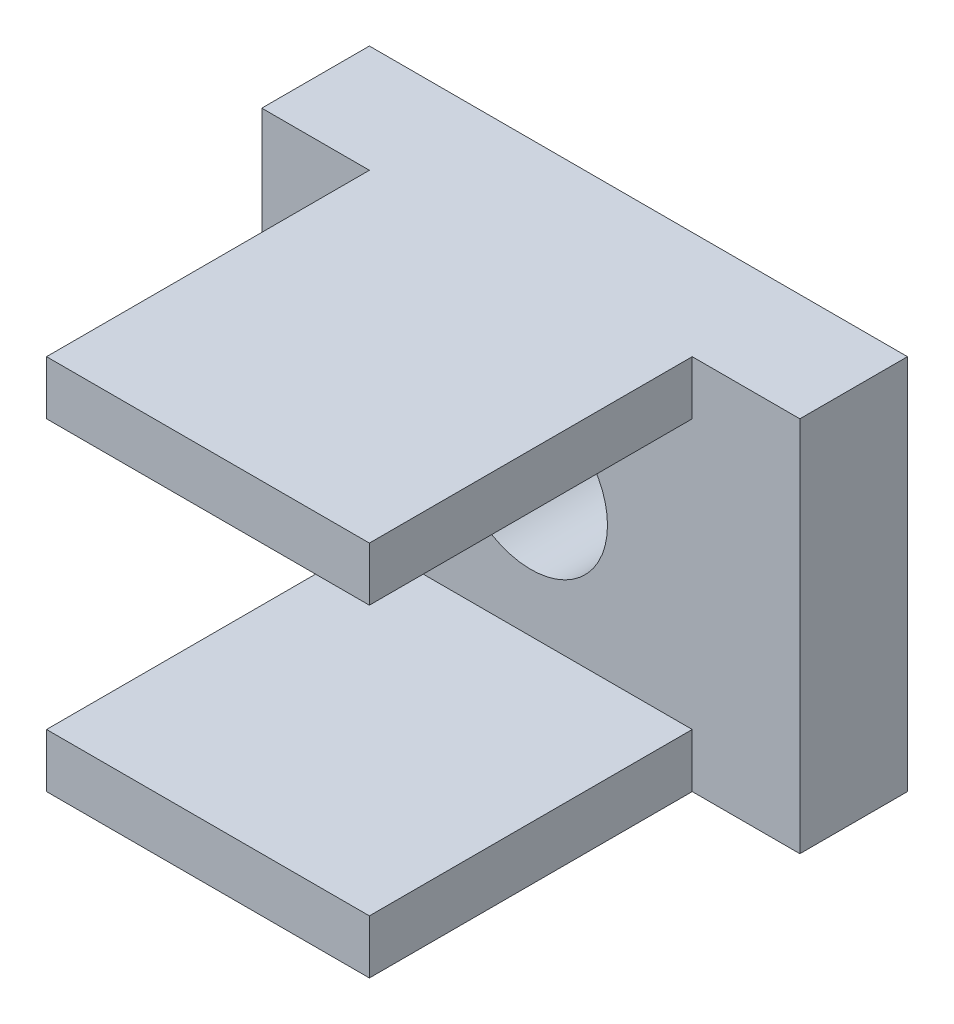
ISO-10303-21;
HEADER;
FILE_DESCRIPTION(('STEP AP214'),'2;1');
FILE_NAME('part.step','',(''),(''),'','','');
FILE_SCHEMA(('AUTOMOTIVE_DESIGN { 1 0 10303 214 1 1 1 1 }'));
ENDSEC;
DATA;
#1=APPLICATION_CONTEXT('core data for automotive mechanical design processes');
#2=APPLICATION_PROTOCOL_DEFINITION('international standard','automotive_design',2000,#1);
#3=PRODUCT_CONTEXT('',#1,'mechanical');
#4=PRODUCT('Part','Part','',(#3));
#5=PRODUCT_RELATED_PRODUCT_CATEGORY('part','',(#4));
#6=PRODUCT_DEFINITION_FORMATION('','',#4);
#7=PRODUCT_DEFINITION_CONTEXT('part definition',#1,'design');
#8=PRODUCT_DEFINITION('design','',#6,#7);
#9=PRODUCT_DEFINITION_SHAPE('','',#8);
#10=(LENGTH_UNIT() NAMED_UNIT(*) SI_UNIT(.MILLI.,.METRE.));
#11=(NAMED_UNIT(*) PLANE_ANGLE_UNIT() SI_UNIT($,.RADIAN.));
#12=(NAMED_UNIT(*) SI_UNIT($,.STERADIAN.) SOLID_ANGLE_UNIT());
#13=UNCERTAINTY_MEASURE_WITH_UNIT(LENGTH_MEASURE(1.E-05),#10,'distance_accuracy_value','');
#14=(GEOMETRIC_REPRESENTATION_CONTEXT(3) GLOBAL_UNCERTAINTY_ASSIGNED_CONTEXT((#13)) GLOBAL_UNIT_ASSIGNED_CONTEXT((#10,
#11,#12)) REPRESENTATION_CONTEXT('',''));
#15=CARTESIAN_POINT('',(0.,0.,0.));
#16=DIRECTION('',(0.,0.,1.));
#17=DIRECTION('',(1.,0.,0.));
#18=AXIS2_PLACEMENT_3D('',#15,#16,#17);
#19=CARTESIAN_POINT('',(0.,0.,0.));
#20=DIRECTION('',(0.,0.,-1.));
#21=DIRECTION('',(-1.,0.,0.));
#22=AXIS2_PLACEMENT_3D('',#19,#20,#21);
#23=PLANE('',#22);
#24=CARTESIAN_POINT('',(0.,0.,0.));
#25=DIRECTION('',(0.,0.,1.));
#26=DIRECTION('',(1.,0.,0.));
#27=AXIS2_PLACEMENT_3D('',#24,#25,#26);
#28=CIRCLE('',#27,1.425);
#29=CARTESIAN_POINT('',(1.425,0.,0.));
#30=VERTEX_POINT('',#29);
#31=EDGE_CURVE('E179',#30,#30,#28,.T.);
#32=ORIENTED_EDGE('',*,*,#31,.F.);
#33=EDGE_LOOP('',(#32));
#34=FACE_BOUND('',#33,.T.);
#35=DIRECTION('',(0.,1.,0.));
#36=VECTOR('',#35,1.);
#37=CARTESIAN_POINT('',(3.,-3.5,0.));
#38=LINE('',#37,#36);
#39=CARTESIAN_POINT('',(3.,-3.5,0.));
#40=VERTEX_POINT('',#39);
#41=CARTESIAN_POINT('',(3.,-2.5,0.));
#42=VERTEX_POINT('',#41);
#43=EDGE_CURVE('E143',#40,#42,#38,.T.);
#44=ORIENTED_EDGE('',*,*,#43,.F.);
#45=DIRECTION('',(1.,0.,0.));
#46=VECTOR('',#45,1.);
#47=CARTESIAN_POINT('',(-5.,-3.5,0.));
#48=LINE('',#47,#46);
#49=CARTESIAN_POINT('',(5.,-3.5,0.));
#50=VERTEX_POINT('',#49);
#51=EDGE_CURVE('E207',#40,#50,#48,.T.);
#52=ORIENTED_EDGE('',*,*,#51,.T.);
#53=DIRECTION('',(0.,1.,0.));
#54=VECTOR('',#53,1.);
#55=CARTESIAN_POINT('',(5.,-3.5,0.));
#56=LINE('',#55,#54);
#57=CARTESIAN_POINT('',(5.,3.5,0.));
#58=VERTEX_POINT('',#57);
#59=EDGE_CURVE('E183',#50,#58,#56,.T.);
#60=ORIENTED_EDGE('',*,*,#59,.T.);
#61=DIRECTION('',(-1.,0.,0.));
#62=VECTOR('',#61,1.);
#63=CARTESIAN_POINT('',(-5.,3.5,0.));
#64=LINE('',#63,#62);
#65=CARTESIAN_POINT('',(3.,3.5,0.));
#66=VERTEX_POINT('',#65);
#67=EDGE_CURVE('E202',#58,#66,#64,.T.);
#68=ORIENTED_EDGE('',*,*,#67,.T.);
#69=DIRECTION('',(0.,1.,0.));
#70=VECTOR('',#69,1.);
#71=CARTESIAN_POINT('',(3.,3.5,0.));
#72=LINE('',#71,#70);
#73=CARTESIAN_POINT('',(3.,2.5,0.));
#74=VERTEX_POINT('',#73);
#75=EDGE_CURVE('E157',#74,#66,#72,.T.);
#76=ORIENTED_EDGE('',*,*,#75,.F.);
#77=DIRECTION('',(1.,0.,0.));
#78=VECTOR('',#77,1.);
#79=CARTESIAN_POINT('',(-3.,2.5,0.));
#80=LINE('',#79,#78);
#81=CARTESIAN_POINT('',(-3.,2.5,0.));
#82=VERTEX_POINT('',#81);
#83=EDGE_CURVE('E147',#82,#74,#80,.T.);
#84=ORIENTED_EDGE('',*,*,#83,.F.);
#85=DIRECTION('',(0.,-1.,0.));
#86=VECTOR('',#85,1.);
#87=CARTESIAN_POINT('',(-3.,3.5,0.));
#88=LINE('',#87,#86);
#89=CARTESIAN_POINT('',(-3.,3.5,0.));
#90=VERTEX_POINT('',#89);
#91=EDGE_CURVE('E144',#90,#82,#88,.T.);
#92=ORIENTED_EDGE('',*,*,#91,.F.);
#93=CARTESIAN_POINT('',(-5.,3.5,0.));
#94=VERTEX_POINT('',#93);
#95=EDGE_CURVE('E201',#90,#94,#64,.T.);
#96=ORIENTED_EDGE('',*,*,#95,.T.);
#97=DIRECTION('',(0.,-1.,0.));
#98=VECTOR('',#97,1.);
#99=CARTESIAN_POINT('',(-5.,-3.5,0.));
#100=LINE('',#99,#98);
#101=CARTESIAN_POINT('',(-5.,-3.5,0.));
#102=VERTEX_POINT('',#101);
#103=EDGE_CURVE('E204',#94,#102,#100,.T.);
#104=ORIENTED_EDGE('',*,*,#103,.T.);
#105=CARTESIAN_POINT('',(-3.,-3.5,0.));
#106=VERTEX_POINT('',#105);
#107=EDGE_CURVE('E190',#102,#106,#48,.T.);
#108=ORIENTED_EDGE('',*,*,#107,.T.);
#109=DIRECTION('',(0.,-1.,0.));
#110=VECTOR('',#109,1.);
#111=CARTESIAN_POINT('',(-3.,-3.5,0.));
#112=LINE('',#111,#110);
#113=CARTESIAN_POINT('',(-3.,-2.5,0.));
#114=VERTEX_POINT('',#113);
#115=EDGE_CURVE('E54',#114,#106,#112,.T.);
#116=ORIENTED_EDGE('',*,*,#115,.F.);
#117=DIRECTION('',(-1.,0.,0.));
#118=VECTOR('',#117,1.);
#119=CARTESIAN_POINT('',(3.,-2.5,0.));
#120=LINE('',#119,#118);
#121=EDGE_CURVE('E49',#42,#114,#120,.T.);
#122=ORIENTED_EDGE('',*,*,#121,.F.);
#123=EDGE_LOOP('',(#44,#52,#60,#68,#76,#84,#92,#96,#104,#108,#116,#122));
#124=FACE_BOUND('',#123,.T.);
#125=ADVANCED_FACE('F32',(#34,#124),#23,.F.);
#126=CARTESIAN_POINT('',(5.,-3.5,-2.));
#127=DIRECTION('',(1.,0.,0.));
#128=DIRECTION('',(0.,0.,-1.));
#129=AXIS2_PLACEMENT_3D('',#126,#127,#128);
#130=PLANE('',#129);
#131=ORIENTED_EDGE('',*,*,#59,.F.);
#132=DIRECTION('',(0.,0.,1.));
#133=VECTOR('',#132,1.);
#134=CARTESIAN_POINT('',(5.,-3.5,-2.));
#135=LINE('',#134,#133);
#136=CARTESIAN_POINT('',(5.,-3.5,-2.));
#137=VERTEX_POINT('',#136);
#138=EDGE_CURVE('E11',#137,#50,#135,.T.);
#139=ORIENTED_EDGE('',*,*,#138,.F.);
#140=DIRECTION('',(0.,1.,0.));
#141=VECTOR('',#140,1.);
#142=CARTESIAN_POINT('',(5.,-3.5,-2.));
#143=LINE('',#142,#141);
#144=CARTESIAN_POINT('',(5.,3.5,-2.));
#145=VERTEX_POINT('',#144);
#146=EDGE_CURVE('E186',#137,#145,#143,.T.);
#147=ORIENTED_EDGE('',*,*,#146,.T.);
#148=DIRECTION('',(0.,0.,1.));
#149=VECTOR('',#148,1.);
#150=CARTESIAN_POINT('',(5.,3.5,-2.));
#151=LINE('',#150,#149);
#152=EDGE_CURVE('E36',#145,#58,#151,.T.);
#153=ORIENTED_EDGE('',*,*,#152,.T.);
#154=EDGE_LOOP('',(#131,#139,#147,#153));
#155=FACE_BOUND('',#154,.T.);
#156=ADVANCED_FACE('F34',(#155),#130,.T.);
#157=CARTESIAN_POINT('',(-5.,-3.5,-2.));
#158=DIRECTION('',(0.,-1.,0.));
#159=DIRECTION('',(0.,0.,-1.));
#160=AXIS2_PLACEMENT_3D('',#157,#158,#159);
#161=PLANE('',#160);
#162=ORIENTED_EDGE('',*,*,#107,.F.);
#163=DIRECTION('',(0.,0.,1.));
#164=VECTOR('',#163,1.);
#165=CARTESIAN_POINT('',(-5.,-3.5,-2.));
#166=LINE('',#165,#164);
#167=CARTESIAN_POINT('',(-5.,-3.5,-2.));
#168=VERTEX_POINT('',#167);
#169=EDGE_CURVE('E41',#168,#102,#166,.T.);
#170=ORIENTED_EDGE('',*,*,#169,.F.);
#171=DIRECTION('',(1.,0.,0.));
#172=VECTOR('',#171,1.);
#173=CARTESIAN_POINT('',(-5.,-3.5,-2.));
#174=LINE('',#173,#172);
#175=EDGE_CURVE('E196',#168,#137,#174,.T.);
#176=ORIENTED_EDGE('',*,*,#175,.T.);
#177=ORIENTED_EDGE('',*,*,#138,.T.);
#178=ORIENTED_EDGE('',*,*,#51,.F.);
#179=DIRECTION('',(0.,0.,-1.));
#180=VECTOR('',#179,1.);
#181=CARTESIAN_POINT('',(3.,-3.5,6.));
#182=LINE('',#181,#180);
#183=CARTESIAN_POINT('',(3.,-3.5,6.));
#184=VERTEX_POINT('',#183);
#185=EDGE_CURVE('E234',#184,#40,#182,.T.);
#186=ORIENTED_EDGE('',*,*,#185,.F.);
#187=DIRECTION('',(1.,0.,0.));
#188=VECTOR('',#187,1.);
#189=CARTESIAN_POINT('',(3.,-3.5,6.));
#190=LINE('',#189,#188);
#191=CARTESIAN_POINT('',(-3.,-3.5,6.));
#192=VERTEX_POINT('',#191);
#193=EDGE_CURVE('E137',#192,#184,#190,.T.);
#194=ORIENTED_EDGE('',*,*,#193,.F.);
#195=DIRECTION('',(0.,0.,-1.));
#196=VECTOR('',#195,1.);
#197=CARTESIAN_POINT('',(-3.,-3.5,6.));
#198=LINE('',#197,#196);
#199=EDGE_CURVE('E149',#192,#106,#198,.T.);
#200=ORIENTED_EDGE('',*,*,#199,.T.);
#201=EDGE_LOOP('',(#162,#170,#176,#177,#178,#186,#194,#200));
#202=FACE_BOUND('',#201,.T.);
#203=ADVANCED_FACE('F224',(#202),#161,.T.);
#204=CARTESIAN_POINT('',(-5.,-3.5,-2.));
#205=DIRECTION('',(-1.,0.,0.));
#206=DIRECTION('',(0.,0.,1.));
#207=AXIS2_PLACEMENT_3D('',#204,#205,#206);
#208=PLANE('',#207);
#209=ORIENTED_EDGE('',*,*,#103,.F.);
#210=DIRECTION('',(0.,0.,1.));
#211=VECTOR('',#210,1.);
#212=CARTESIAN_POINT('',(-5.,3.5,-2.));
#213=LINE('',#212,#211);
#214=CARTESIAN_POINT('',(-5.,3.5,-2.));
#215=VERTEX_POINT('',#214);
#216=EDGE_CURVE('E209',#215,#94,#213,.T.);
#217=ORIENTED_EDGE('',*,*,#216,.F.);
#218=DIRECTION('',(0.,-1.,0.));
#219=VECTOR('',#218,1.);
#220=CARTESIAN_POINT('',(-5.,-3.5,-2.));
#221=LINE('',#220,#219);
#222=EDGE_CURVE('E193',#215,#168,#221,.T.);
#223=ORIENTED_EDGE('',*,*,#222,.T.);
#224=ORIENTED_EDGE('',*,*,#169,.T.);
#225=EDGE_LOOP('',(#209,#217,#223,#224));
#226=FACE_BOUND('',#225,.T.);
#227=ADVANCED_FACE('F230',(#226),#208,.T.);
#228=CARTESIAN_POINT('',(-5.,3.5,-2.));
#229=DIRECTION('',(0.,1.,0.));
#230=DIRECTION('',(0.,0.,1.));
#231=AXIS2_PLACEMENT_3D('',#228,#229,#230);
#232=PLANE('',#231);
#233=ORIENTED_EDGE('',*,*,#67,.F.);
#234=ORIENTED_EDGE('',*,*,#152,.F.);
#235=DIRECTION('',(-1.,0.,0.));
#236=VECTOR('',#235,1.);
#237=CARTESIAN_POINT('',(-5.,3.5,-2.));
#238=LINE('',#237,#236);
#239=EDGE_CURVE('E189',#145,#215,#238,.T.);
#240=ORIENTED_EDGE('',*,*,#239,.T.);
#241=ORIENTED_EDGE('',*,*,#216,.T.);
#242=ORIENTED_EDGE('',*,*,#95,.F.);
#243=DIRECTION('',(0.,0.,-1.));
#244=VECTOR('',#243,1.);
#245=CARTESIAN_POINT('',(-3.,3.5,6.));
#246=LINE('',#245,#244);
#247=CARTESIAN_POINT('',(-3.,3.5,6.));
#248=VERTEX_POINT('',#247);
#249=EDGE_CURVE('E162',#248,#90,#246,.T.);
#250=ORIENTED_EDGE('',*,*,#249,.F.);
#251=DIRECTION('',(-1.,0.,0.));
#252=VECTOR('',#251,1.);
#253=CARTESIAN_POINT('',(-3.,3.5,6.));
#254=LINE('',#253,#252);
#255=CARTESIAN_POINT('',(3.,3.5,6.));
#256=VERTEX_POINT('',#255);
#257=EDGE_CURVE('E161',#256,#248,#254,.T.);
#258=ORIENTED_EDGE('',*,*,#257,.F.);
#259=DIRECTION('',(0.,0.,-1.));
#260=VECTOR('',#259,1.);
#261=CARTESIAN_POINT('',(3.,3.5,6.));
#262=LINE('',#261,#260);
#263=EDGE_CURVE('E170',#256,#66,#262,.T.);
#264=ORIENTED_EDGE('',*,*,#263,.T.);
#265=EDGE_LOOP('',(#233,#234,#240,#241,#242,#250,#258,#264));
#266=FACE_BOUND('',#265,.T.);
#267=ADVANCED_FACE('F219',(#266),#232,.T.);
#268=CARTESIAN_POINT('',(0.,0.,-2.));
#269=DIRECTION('',(0.,0.,-1.));
#270=DIRECTION('',(-1.,0.,0.));
#271=AXIS2_PLACEMENT_3D('',#268,#269,#270);
#272=PLANE('',#271);
#273=CARTESIAN_POINT('',(0.,0.,-2.));
#274=DIRECTION('',(0.,0.,1.));
#275=DIRECTION('',(1.,0.,0.));
#276=AXIS2_PLACEMENT_3D('',#273,#274,#275);
#277=CIRCLE('',#276,1.425);
#278=CARTESIAN_POINT('',(1.425,0.,-2.));
#279=VERTEX_POINT('',#278);
#280=EDGE_CURVE('E180',#279,#279,#277,.T.);
#281=ORIENTED_EDGE('',*,*,#280,.T.);
#282=EDGE_LOOP('',(#281));
#283=FACE_BOUND('',#282,.T.);
#284=ORIENTED_EDGE('',*,*,#146,.F.);
#285=ORIENTED_EDGE('',*,*,#175,.F.);
#286=ORIENTED_EDGE('',*,*,#222,.F.);
#287=ORIENTED_EDGE('',*,*,#239,.F.);
#288=EDGE_LOOP('',(#284,#285,#286,#287));
#289=FACE_BOUND('',#288,.T.);
#290=ADVANCED_FACE('F227',(#283,#289),#272,.T.);
#291=CARTESIAN_POINT('',(0.,0.,-2.));
#292=DIRECTION('',(0.,0.,1.));
#293=DIRECTION('',(1.,0.,0.));
#294=AXIS2_PLACEMENT_3D('',#291,#292,#293);
#295=CYLINDRICAL_SURFACE('',#294,1.425);
#296=ORIENTED_EDGE('',*,*,#280,.F.);
#297=EDGE_LOOP('',(#296));
#298=FACE_BOUND('',#297,.T.);
#299=ORIENTED_EDGE('',*,*,#31,.T.);
#300=EDGE_LOOP('',(#299));
#301=FACE_BOUND('',#300,.T.);
#302=ADVANCED_FACE('F267',(#298,#301),#295,.F.);
#303=CARTESIAN_POINT('',(-3.,3.5,6.));
#304=DIRECTION('',(1.,0.,0.));
#305=DIRECTION('',(0.,0.,-1.));
#306=AXIS2_PLACEMENT_3D('',#303,#304,#305);
#307=PLANE('',#306);
#308=ORIENTED_EDGE('',*,*,#91,.T.);
#309=DIRECTION('',(0.,0.,-1.));
#310=VECTOR('',#309,1.);
#311=CARTESIAN_POINT('',(-3.,2.5,6.));
#312=LINE('',#311,#310);
#313=CARTESIAN_POINT('',(-3.,2.5,6.));
#314=VERTEX_POINT('',#313);
#315=EDGE_CURVE('E176',#314,#82,#312,.T.);
#316=ORIENTED_EDGE('',*,*,#315,.F.);
#317=DIRECTION('',(0.,-1.,0.));
#318=VECTOR('',#317,1.);
#319=CARTESIAN_POINT('',(-3.,3.5,6.));
#320=LINE('',#319,#318);
#321=EDGE_CURVE('E153',#248,#314,#320,.T.);
#322=ORIENTED_EDGE('',*,*,#321,.F.);
#323=ORIENTED_EDGE('',*,*,#249,.T.);
#324=EDGE_LOOP('',(#308,#316,#322,#323));
#325=FACE_BOUND('',#324,.T.);
#326=ADVANCED_FACE('F272',(#325),#307,.F.);
#327=CARTESIAN_POINT('',(-3.,2.5,6.));
#328=DIRECTION('',(0.,1.,0.));
#329=DIRECTION('',(-1.,0.,0.));
#330=AXIS2_PLACEMENT_3D('',#327,#328,#329);
#331=PLANE('',#330);
#332=ORIENTED_EDGE('',*,*,#83,.T.);
#333=DIRECTION('',(0.,0.,-1.));
#334=VECTOR('',#333,1.);
#335=CARTESIAN_POINT('',(3.,2.5,6.));
#336=LINE('',#335,#334);
#337=CARTESIAN_POINT('',(3.,2.5,6.));
#338=VERTEX_POINT('',#337);
#339=EDGE_CURVE('E173',#338,#74,#336,.T.);
#340=ORIENTED_EDGE('',*,*,#339,.F.);
#341=DIRECTION('',(1.,0.,0.));
#342=VECTOR('',#341,1.);
#343=CARTESIAN_POINT('',(-3.,2.5,6.));
#344=LINE('',#343,#342);
#345=EDGE_CURVE('E156',#314,#338,#344,.T.);
#346=ORIENTED_EDGE('',*,*,#345,.F.);
#347=ORIENTED_EDGE('',*,*,#315,.T.);
#348=EDGE_LOOP('',(#332,#340,#346,#347));
#349=FACE_BOUND('',#348,.T.);
#350=ADVANCED_FACE('F279',(#349),#331,.F.);
#351=CARTESIAN_POINT('',(3.,3.5,6.));
#352=DIRECTION('',(-1.,0.,0.));
#353=DIRECTION('',(0.,0.,1.));
#354=AXIS2_PLACEMENT_3D('',#351,#352,#353);
#355=PLANE('',#354);
#356=ORIENTED_EDGE('',*,*,#75,.T.);
#357=ORIENTED_EDGE('',*,*,#263,.F.);
#358=DIRECTION('',(0.,1.,0.));
#359=VECTOR('',#358,1.);
#360=CARTESIAN_POINT('',(3.,3.5,6.));
#361=LINE('',#360,#359);
#362=EDGE_CURVE('E159',#338,#256,#361,.T.);
#363=ORIENTED_EDGE('',*,*,#362,.F.);
#364=ORIENTED_EDGE('',*,*,#339,.T.);
#365=EDGE_LOOP('',(#356,#357,#363,#364));
#366=FACE_BOUND('',#365,.T.);
#367=ADVANCED_FACE('F285',(#366),#355,.F.);
#368=CARTESIAN_POINT('',(0.,0.,6.));
#369=DIRECTION('',(0.,0.,1.));
#370=DIRECTION('',(1.,0.,0.));
#371=AXIS2_PLACEMENT_3D('',#368,#369,#370);
#372=PLANE('',#371);
#373=ORIENTED_EDGE('',*,*,#321,.T.);
#374=ORIENTED_EDGE('',*,*,#345,.T.);
#375=ORIENTED_EDGE('',*,*,#362,.T.);
#376=ORIENTED_EDGE('',*,*,#257,.T.);
#377=EDGE_LOOP('',(#373,#374,#375,#376));
#378=FACE_BOUND('',#377,.T.);
#379=ADVANCED_FACE('F289',(#378),#372,.T.);
#380=CARTESIAN_POINT('',(3.,-3.5,6.));
#381=DIRECTION('',(-1.,0.,0.));
#382=DIRECTION('',(0.,0.,1.));
#383=AXIS2_PLACEMENT_3D('',#380,#381,#382);
#384=PLANE('',#383);
#385=ORIENTED_EDGE('',*,*,#43,.T.);
#386=DIRECTION('',(0.,0.,-1.));
#387=VECTOR('',#386,1.);
#388=CARTESIAN_POINT('',(3.,-2.5,6.));
#389=LINE('',#388,#387);
#390=CARTESIAN_POINT('',(3.,-2.5,6.));
#391=VERTEX_POINT('',#390);
#392=EDGE_CURVE('E125',#391,#42,#389,.T.);
#393=ORIENTED_EDGE('',*,*,#392,.F.);
#394=DIRECTION('',(0.,1.,0.));
#395=VECTOR('',#394,1.);
#396=CARTESIAN_POINT('',(3.,-3.5,6.));
#397=LINE('',#396,#395);
#398=EDGE_CURVE('E132',#184,#391,#397,.T.);
#399=ORIENTED_EDGE('',*,*,#398,.F.);
#400=ORIENTED_EDGE('',*,*,#185,.T.);
#401=EDGE_LOOP('',(#385,#393,#399,#400));
#402=FACE_BOUND('',#401,.T.);
#403=ADVANCED_FACE('F142',(#402),#384,.F.);
#404=CARTESIAN_POINT('',(3.,-2.5,6.));
#405=DIRECTION('',(0.,-1.,0.));
#406=DIRECTION('',(0.,0.,-1.));
#407=AXIS2_PLACEMENT_3D('',#404,#405,#406);
#408=PLANE('',#407);
#409=ORIENTED_EDGE('',*,*,#121,.T.);
#410=DIRECTION('',(0.,0.,-1.));
#411=VECTOR('',#410,1.);
#412=CARTESIAN_POINT('',(-3.,-2.5,6.));
#413=LINE('',#412,#411);
#414=CARTESIAN_POINT('',(-3.,-2.5,6.));
#415=VERTEX_POINT('',#414);
#416=EDGE_CURVE('E128',#415,#114,#413,.T.);
#417=ORIENTED_EDGE('',*,*,#416,.F.);
#418=DIRECTION('',(-1.,0.,0.));
#419=VECTOR('',#418,1.);
#420=CARTESIAN_POINT('',(3.,-2.5,6.));
#421=LINE('',#420,#419);
#422=EDGE_CURVE('E121',#391,#415,#421,.T.);
#423=ORIENTED_EDGE('',*,*,#422,.F.);
#424=ORIENTED_EDGE('',*,*,#392,.T.);
#425=EDGE_LOOP('',(#409,#417,#423,#424));
#426=FACE_BOUND('',#425,.T.);
#427=ADVANCED_FACE('F123',(#426),#408,.F.);
#428=CARTESIAN_POINT('',(-3.,-3.5,6.));
#429=DIRECTION('',(1.,0.,0.));
#430=DIRECTION('',(0.,0.,-1.));
#431=AXIS2_PLACEMENT_3D('',#428,#429,#430);
#432=PLANE('',#431);
#433=ORIENTED_EDGE('',*,*,#115,.T.);
#434=ORIENTED_EDGE('',*,*,#199,.F.);
#435=DIRECTION('',(0.,-1.,0.));
#436=VECTOR('',#435,1.);
#437=CARTESIAN_POINT('',(-3.,-3.5,6.));
#438=LINE('',#437,#436);
#439=EDGE_CURVE('E131',#415,#192,#438,.T.);
#440=ORIENTED_EDGE('',*,*,#439,.F.);
#441=ORIENTED_EDGE('',*,*,#416,.T.);
#442=EDGE_LOOP('',(#433,#434,#440,#441));
#443=FACE_BOUND('',#442,.T.);
#444=ADVANCED_FACE('F241',(#443),#432,.F.);
#445=CARTESIAN_POINT('',(0.,0.,6.));
#446=DIRECTION('',(0.,0.,1.));
#447=DIRECTION('',(1.,0.,0.));
#448=AXIS2_PLACEMENT_3D('',#445,#446,#447);
#449=PLANE('',#448);
#450=ORIENTED_EDGE('',*,*,#398,.T.);
#451=ORIENTED_EDGE('',*,*,#422,.T.);
#452=ORIENTED_EDGE('',*,*,#439,.T.);
#453=ORIENTED_EDGE('',*,*,#193,.T.);
#454=EDGE_LOOP('',(#450,#451,#452,#453));
#455=FACE_BOUND('',#454,.T.);
#456=ADVANCED_FACE('F135',(#455),#449,.T.);
#457=CLOSED_SHELL('',(#125,#156,#203,#227,#267,#290,#302,#326,#350,#367,#379,#403,#427,#444,#456));
#458=MANIFOLD_SOLID_BREP('B2',#457);
#459=ADVANCED_BREP_SHAPE_REPRESENTATION('',(#18,#458),#14);
#460=SHAPE_DEFINITION_REPRESENTATION(#9,#459);
ENDSEC;
END-ISO-10303-21;
